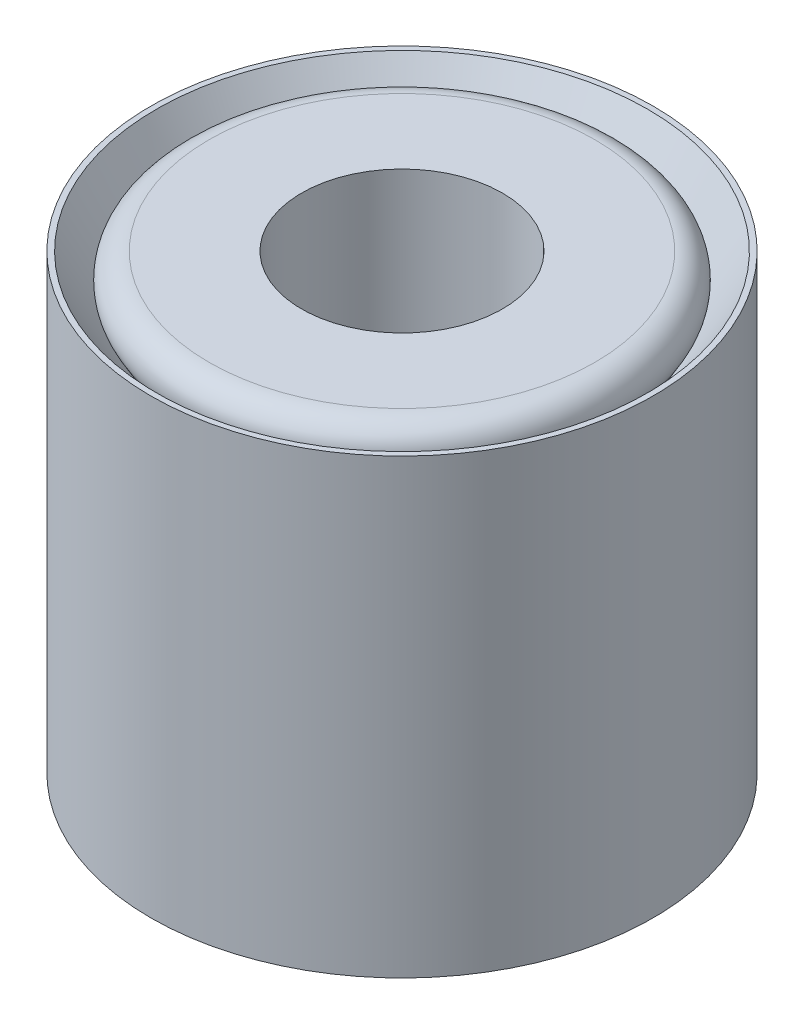
ISO-10303-21;
HEADER;
FILE_DESCRIPTION(('STEP AP214'),'2;1');
FILE_NAME('part.step','',(''),(''),'','','');
FILE_SCHEMA(('AUTOMOTIVE_DESIGN { 1 0 10303 214 1 1 1 1 }'));
ENDSEC;
DATA;
#1=APPLICATION_CONTEXT('core data for automotive mechanical design processes');
#2=APPLICATION_PROTOCOL_DEFINITION('international standard','automotive_design',2000,#1);
#3=PRODUCT_CONTEXT('',#1,'mechanical');
#4=PRODUCT('Part','Part','',(#3));
#5=PRODUCT_RELATED_PRODUCT_CATEGORY('part','',(#4));
#6=PRODUCT_DEFINITION_FORMATION('','',#4);
#7=PRODUCT_DEFINITION_CONTEXT('part definition',#1,'design');
#8=PRODUCT_DEFINITION('design','',#6,#7);
#9=PRODUCT_DEFINITION_SHAPE('','',#8);
#10=(LENGTH_UNIT() NAMED_UNIT(*) SI_UNIT(.MILLI.,.METRE.));
#11=(NAMED_UNIT(*) PLANE_ANGLE_UNIT() SI_UNIT($,.RADIAN.));
#12=(NAMED_UNIT(*) SI_UNIT($,.STERADIAN.) SOLID_ANGLE_UNIT());
#13=UNCERTAINTY_MEASURE_WITH_UNIT(LENGTH_MEASURE(1.E-05),#10,'distance_accuracy_value','');
#14=(GEOMETRIC_REPRESENTATION_CONTEXT(3) GLOBAL_UNCERTAINTY_ASSIGNED_CONTEXT((#13)) GLOBAL_UNIT_ASSIGNED_CONTEXT((#10,
#11,#12)) REPRESENTATION_CONTEXT('',''));
#15=CARTESIAN_POINT('',(0.,0.,0.));
#16=DIRECTION('',(0.,0.,1.));
#17=DIRECTION('',(1.,0.,0.));
#18=AXIS2_PLACEMENT_3D('',#15,#16,#17);
#19=CARTESIAN_POINT('',(0.,-4.5,0.));
#20=DIRECTION('',(0.,-1.,0.));
#21=DIRECTION('',(0.,0.,-1.));
#22=AXIS2_PLACEMENT_3D('',#19,#20,#21);
#23=CYLINDRICAL_SURFACE('',#22,5.);
#24=CARTESIAN_POINT('',(0.,4.5,0.));
#25=DIRECTION('',(0.,-1.,0.));
#26=DIRECTION('',(0.,0.,-1.));
#27=AXIS2_PLACEMENT_3D('',#24,#25,#26);
#28=CIRCLE('',#27,5.);
#29=CARTESIAN_POINT('',(0.,4.5,-5.));
#30=VERTEX_POINT('',#29);
#31=EDGE_CURVE('E56',#30,#30,#28,.T.);
#32=ORIENTED_EDGE('',*,*,#31,.T.);
#33=EDGE_LOOP('',(#32));
#34=FACE_BOUND('',#33,.T.);
#35=CARTESIAN_POINT('',(0.,-4.5,0.));
#36=DIRECTION('',(0.,-1.,0.));
#37=DIRECTION('',(0.,0.,-1.));
#38=AXIS2_PLACEMENT_3D('',#35,#36,#37);
#39=CIRCLE('',#38,5.);
#40=CARTESIAN_POINT('',(0.,-4.5,-5.));
#41=VERTEX_POINT('',#40);
#42=EDGE_CURVE('E68',#41,#41,#39,.T.);
#43=ORIENTED_EDGE('',*,*,#42,.F.);
#44=EDGE_LOOP('',(#43));
#45=FACE_BOUND('',#44,.T.);
#46=ADVANCED_FACE('F45',(#34,#45),#23,.T.);
#47=CARTESIAN_POINT('',(5.,4.5,0.));
#48=DIRECTION('',(0.,1.,0.));
#49=DIRECTION('',(0.,0.,1.));
#50=AXIS2_PLACEMENT_3D('',#47,#48,#49);
#51=PLANE('',#50);
#52=CARTESIAN_POINT('',(0.,4.5,0.));
#53=DIRECTION('',(0.,-1.,0.));
#54=DIRECTION('',(0.,0.,-1.));
#55=AXIS2_PLACEMENT_3D('',#52,#53,#54);
#56=CIRCLE('',#55,4.89141414874699);
#57=CARTESIAN_POINT('',(0.,4.5,-4.89141414874699));
#58=VERTEX_POINT('',#57);
#59=EDGE_CURVE('E60',#58,#58,#56,.T.);
#60=ORIENTED_EDGE('',*,*,#59,.T.);
#61=EDGE_LOOP('',(#60));
#62=FACE_BOUND('',#61,.T.);
#63=ORIENTED_EDGE('',*,*,#31,.F.);
#64=EDGE_LOOP('',(#63));
#65=FACE_BOUND('',#64,.T.);
#66=ADVANCED_FACE('F76',(#62,#65),#51,.T.);
#67=CARTESIAN_POINT('',(0.,4.5,0.));
#68=DIRECTION('',(0.,1.,0.));
#69=DIRECTION('',(0.,0.,1.));
#70=AXIS2_PLACEMENT_3D('',#67,#68,#69);
#71=CONICAL_SURFACE('',#70,4.89141414874699,0.523598775598296);
#72=CARTESIAN_POINT('',(0.,0.499999999999995,0.));
#73=DIRECTION('',(0.,-1.,0.));
#74=DIRECTION('',(0.,0.,-1.));
#75=AXIS2_PLACEMENT_3D('',#72,#73,#74);
#76=CIRCLE('',#75,2.5820130719885);
#77=CARTESIAN_POINT('',(0.,0.499999999999995,-2.5820130719885));
#78=VERTEX_POINT('',#77);
#79=EDGE_CURVE('E52',#78,#78,#76,.T.);
#80=ORIENTED_EDGE('',*,*,#79,.T.);
#81=EDGE_LOOP('',(#80));
#82=FACE_BOUND('',#81,.T.);
#83=ORIENTED_EDGE('',*,*,#59,.F.);
#84=EDGE_LOOP('',(#83));
#85=FACE_BOUND('',#84,.T.);
#86=ADVANCED_FACE('F81',(#82,#85),#71,.F.);
#87=CARTESIAN_POINT('',(0.,0.,0.));
#88=DIRECTION('',(0.,-1.,0.));
#89=DIRECTION('',(0.,0.,-1.));
#90=AXIS2_PLACEMENT_3D('',#87,#88,#89);
#91=CONICAL_SURFACE('',#90,2.29333793739369,0.523598775598299);
#92=CARTESIAN_POINT('',(0.,-0.500000000000002,0.));
#93=DIRECTION('',(0.,1.,0.));
#94=DIRECTION('',(0.,0.,1.));
#95=AXIS2_PLACEMENT_3D('',#92,#93,#94);
#96=CIRCLE('',#95,2.5820130719885);
#97=CARTESIAN_POINT('',(0.,-0.500000000000002,2.5820130719885));
#98=VERTEX_POINT('',#97);
#99=EDGE_CURVE('E11',#98,#98,#96,.T.);
#100=ORIENTED_EDGE('',*,*,#99,.T.);
#101=EDGE_LOOP('',(#100));
#102=FACE_BOUND('',#101,.T.);
#103=CARTESIAN_POINT('',(0.,-4.5,0.));
#104=DIRECTION('',(0.,-1.,0.));
#105=DIRECTION('',(0.,0.,-1.));
#106=AXIS2_PLACEMENT_3D('',#103,#104,#105);
#107=CIRCLE('',#106,4.891414148747);
#108=CARTESIAN_POINT('',(0.,-4.5,-4.891414148747));
#109=VERTEX_POINT('',#108);
#110=EDGE_CURVE('E65',#109,#109,#107,.T.);
#111=ORIENTED_EDGE('',*,*,#110,.T.);
#112=EDGE_LOOP('',(#111));
#113=FACE_BOUND('',#112,.T.);
#114=ADVANCED_FACE('F87',(#102,#113),#91,.F.);
#115=CARTESIAN_POINT('',(5.,-4.5,0.));
#116=DIRECTION('',(0.,-1.,0.));
#117=DIRECTION('',(0.,0.,-1.));
#118=AXIS2_PLACEMENT_3D('',#115,#116,#117);
#119=PLANE('',#118);
#120=ORIENTED_EDGE('',*,*,#42,.T.);
#121=EDGE_LOOP('',(#120));
#122=FACE_BOUND('',#121,.T.);
#123=ORIENTED_EDGE('',*,*,#110,.F.);
#124=EDGE_LOOP('',(#123));
#125=FACE_BOUND('',#124,.T.);
#126=ADVANCED_FACE('F72',(#122,#125),#119,.T.);
#127=CARTESIAN_POINT('',(0.,0.,0.));
#128=DIRECTION('',(0.,1.,0.));
#129=DIRECTION('',(0.,0.,1.));
#130=AXIS2_PLACEMENT_3D('',#127,#128,#129);
#131=TOROIDAL_SURFACE('',#130,3.44803847577294,1.);
#132=ORIENTED_EDGE('',*,*,#99,.F.);
#133=EDGE_LOOP('',(#132));
#134=FACE_BOUND('',#133,.T.);
#135=ORIENTED_EDGE('',*,*,#79,.F.);
#136=EDGE_LOOP('',(#135));
#137=FACE_BOUND('',#136,.T.);
#138=ADVANCED_FACE('F47',(#134,#137),#131,.T.);
#139=CLOSED_SHELL('',(#46,#66,#86,#114,#126,#138));
#140=MANIFOLD_SOLID_BREP('B2',#139);
#141=CARTESIAN_POINT('',(4.70666206260631,4.5,0.));
#142=DIRECTION('',(0.,1.,0.));
#143=DIRECTION('',(0.,0.,1.));
#144=AXIS2_PLACEMENT_3D('',#141,#142,#143);
#145=PLANE('',#144);
#146=CARTESIAN_POINT('',(0.,4.5,0.));
#147=DIRECTION('',(0.,1.,0.));
#148=DIRECTION('',(0.,0.,1.));
#149=AXIS2_PLACEMENT_3D('',#146,#147,#148);
#150=CIRCLE('',#149,3.84063665882187);
#151=CARTESIAN_POINT('',(0.,4.5,3.84063665882187));
#152=VERTEX_POINT('',#151);
#153=EDGE_CURVE('E44',#152,#152,#150,.T.);
#154=ORIENTED_EDGE('',*,*,#153,.T.);
#155=EDGE_LOOP('',(#154));
#156=FACE_BOUND('',#155,.T.);
#157=CARTESIAN_POINT('',(0.,4.5,0.));
#158=DIRECTION('',(0.,-1.,0.));
#159=DIRECTION('',(0.,0.,-1.));
#160=AXIS2_PLACEMENT_3D('',#157,#158,#159);
#161=CIRCLE('',#160,2.);
#162=CARTESIAN_POINT('',(0.,4.5,-2.));
#163=VERTEX_POINT('',#162);
#164=EDGE_CURVE('E178',#163,#163,#161,.T.);
#165=ORIENTED_EDGE('',*,*,#164,.T.);
#166=EDGE_LOOP('',(#165));
#167=FACE_BOUND('',#166,.T.);
#168=ADVANCED_FACE('F149',(#156,#167),#145,.T.);
#169=CARTESIAN_POINT('',(0.,0.,0.));
#170=DIRECTION('',(0.,1.,0.));
#171=DIRECTION('',(0.,0.,1.));
#172=AXIS2_PLACEMENT_3D('',#169,#170,#171);
#173=CONICAL_SURFACE('',#172,2.10858585125301,0.523598775598296);
#174=CARTESIAN_POINT('',(0.,3.75,0.));
#175=DIRECTION('',(0.,-1.,0.));
#176=DIRECTION('',(0.,0.,-1.));
#177=AXIS2_PLACEMENT_3D('',#174,#175,#176);
#178=CIRCLE('',#177,4.27364936071409);
#179=CARTESIAN_POINT('',(0.,3.75,-4.27364936071409));
#180=VERTEX_POINT('',#179);
#181=EDGE_CURVE('E156',#180,#180,#178,.T.);
#182=ORIENTED_EDGE('',*,*,#181,.T.);
#183=EDGE_LOOP('',(#182));
#184=FACE_BOUND('',#183,.T.);
#185=CARTESIAN_POINT('',(0.,0.,0.));
#186=DIRECTION('',(0.,-1.,0.));
#187=DIRECTION('',(0.,0.,-1.));
#188=AXIS2_PLACEMENT_3D('',#185,#186,#187);
#189=CIRCLE('',#188,2.10858585125301);
#190=CARTESIAN_POINT('',(0.,0.,-2.10858585125301));
#191=VERTEX_POINT('',#190);
#192=EDGE_CURVE('E175',#191,#191,#189,.T.);
#193=ORIENTED_EDGE('',*,*,#192,.F.);
#194=EDGE_LOOP('',(#193));
#195=FACE_BOUND('',#194,.T.);
#196=ADVANCED_FACE('F200',(#184,#195),#173,.T.);
#197=CARTESIAN_POINT('',(0.,-4.5,0.));
#198=DIRECTION('',(0.,-1.,0.));
#199=DIRECTION('',(0.,0.,-1.));
#200=AXIS2_PLACEMENT_3D('',#197,#198,#199);
#201=CONICAL_SURFACE('',#200,4.70666206260632,0.523598775598299);
#202=CARTESIAN_POINT('',(0.,-3.75,0.));
#203=DIRECTION('',(0.,1.,0.));
#204=DIRECTION('',(0.,0.,1.));
#205=AXIS2_PLACEMENT_3D('',#202,#203,#204);
#206=CIRCLE('',#205,4.2736493607141);
#207=CARTESIAN_POINT('',(0.,-3.75,4.2736493607141));
#208=VERTEX_POINT('',#207);
#209=EDGE_CURVE('E160',#208,#208,#206,.T.);
#210=ORIENTED_EDGE('',*,*,#209,.T.);
#211=EDGE_LOOP('',(#210));
#212=FACE_BOUND('',#211,.T.);
#213=ORIENTED_EDGE('',*,*,#192,.T.);
#214=EDGE_LOOP('',(#213));
#215=FACE_BOUND('',#214,.T.);
#216=ADVANCED_FACE('F196',(#212,#215),#201,.T.);
#217=CARTESIAN_POINT('',(4.70666206260632,-4.5,0.));
#218=DIRECTION('',(0.,-1.,0.));
#219=DIRECTION('',(0.,0.,-1.));
#220=AXIS2_PLACEMENT_3D('',#217,#218,#219);
#221=PLANE('',#220);
#222=CARTESIAN_POINT('',(0.,-4.5,0.));
#223=DIRECTION('',(0.,-1.,0.));
#224=DIRECTION('',(0.,0.,-1.));
#225=AXIS2_PLACEMENT_3D('',#222,#223,#224);
#226=CIRCLE('',#225,2.5);
#227=CARTESIAN_POINT('',(0.,-4.5,-2.5));
#228=VERTEX_POINT('',#227);
#229=EDGE_CURVE('E164',#228,#228,#226,.F.);
#230=ORIENTED_EDGE('',*,*,#229,.T.);
#231=EDGE_LOOP('',(#230));
#232=FACE_BOUND('',#231,.T.);
#233=CARTESIAN_POINT('',(0.,-4.5,0.));
#234=DIRECTION('',(0.,-1.,0.));
#235=DIRECTION('',(0.,0.,-1.));
#236=AXIS2_PLACEMENT_3D('',#233,#234,#235);
#237=CIRCLE('',#236,3.84063665882188);
#238=CARTESIAN_POINT('',(0.,-4.5,-3.84063665882188));
#239=VERTEX_POINT('',#238);
#240=EDGE_CURVE('E169',#239,#239,#237,.T.);
#241=ORIENTED_EDGE('',*,*,#240,.T.);
#242=EDGE_LOOP('',(#241));
#243=FACE_BOUND('',#242,.T.);
#244=ADVANCED_FACE('F186',(#232,#243),#221,.T.);
#245=CARTESIAN_POINT('',(0.,-4.5,0.));
#246=DIRECTION('',(0.,-1.,0.));
#247=DIRECTION('',(0.,0.,-1.));
#248=AXIS2_PLACEMENT_3D('',#245,#246,#247);
#249=CYLINDRICAL_SURFACE('',#248,2.);
#250=CARTESIAN_POINT('',(0.,-4.,0.));
#251=DIRECTION('',(0.,-1.,0.));
#252=DIRECTION('',(0.,0.,-1.));
#253=AXIS2_PLACEMENT_3D('',#250,#251,#252);
#254=CIRCLE('',#253,2.);
#255=CARTESIAN_POINT('',(0.,-4.,-2.));
#256=VERTEX_POINT('',#255);
#257=EDGE_CURVE('E172',#256,#256,#254,.T.);
#258=ORIENTED_EDGE('',*,*,#257,.T.);
#259=EDGE_LOOP('',(#258));
#260=FACE_BOUND('',#259,.T.);
#261=ORIENTED_EDGE('',*,*,#164,.F.);
#262=EDGE_LOOP('',(#261));
#263=FACE_BOUND('',#262,.T.);
#264=ADVANCED_FACE('F183',(#260,#263),#249,.F.);
#265=CARTESIAN_POINT('',(0.,-4.,0.));
#266=DIRECTION('',(0.,-1.,0.));
#267=DIRECTION('',(0.,0.,-1.));
#268=AXIS2_PLACEMENT_3D('',#265,#266,#267);
#269=TOROIDAL_SURFACE('',#268,2.5,0.5);
#270=ORIENTED_EDGE('',*,*,#229,.F.);
#271=EDGE_LOOP('',(#270));
#272=FACE_BOUND('',#271,.T.);
#273=ORIENTED_EDGE('',*,*,#257,.F.);
#274=EDGE_LOOP('',(#273));
#275=FACE_BOUND('',#274,.T.);
#276=ADVANCED_FACE('F185',(#272,#275),#269,.T.);
#277=CARTESIAN_POINT('',(0.,-4.,0.));
#278=DIRECTION('',(0.,-1.,0.));
#279=DIRECTION('',(0.,0.,-1.));
#280=AXIS2_PLACEMENT_3D('',#277,#278,#279);
#281=TOROIDAL_SURFACE('',#280,3.84063665882188,0.5);
#282=ORIENTED_EDGE('',*,*,#209,.F.);
#283=EDGE_LOOP('',(#282));
#284=FACE_BOUND('',#283,.T.);
#285=ORIENTED_EDGE('',*,*,#240,.F.);
#286=EDGE_LOOP('',(#285));
#287=FACE_BOUND('',#286,.T.);
#288=ADVANCED_FACE('F193',(#284,#287),#281,.T.);
#289=CARTESIAN_POINT('',(0.,4.,0.));
#290=DIRECTION('',(0.,1.,0.));
#291=DIRECTION('',(0.,0.,1.));
#292=AXIS2_PLACEMENT_3D('',#289,#290,#291);
#293=TOROIDAL_SURFACE('',#292,3.84063665882187,0.5);
#294=ORIENTED_EDGE('',*,*,#153,.F.);
#295=EDGE_LOOP('',(#294));
#296=FACE_BOUND('',#295,.T.);
#297=ORIENTED_EDGE('',*,*,#181,.F.);
#298=EDGE_LOOP('',(#297));
#299=FACE_BOUND('',#298,.T.);
#300=ADVANCED_FACE('F151',(#296,#299),#293,.T.);
#301=CLOSED_SHELL('',(#168,#196,#216,#244,#264,#276,#288,#300));
#302=MANIFOLD_SOLID_BREP('B6',#301);
#303=ADVANCED_BREP_SHAPE_REPRESENTATION('',(#18,#140,#302),#14);
#304=SHAPE_DEFINITION_REPRESENTATION(#9,#303);
ENDSEC;
END-ISO-10303-21;
